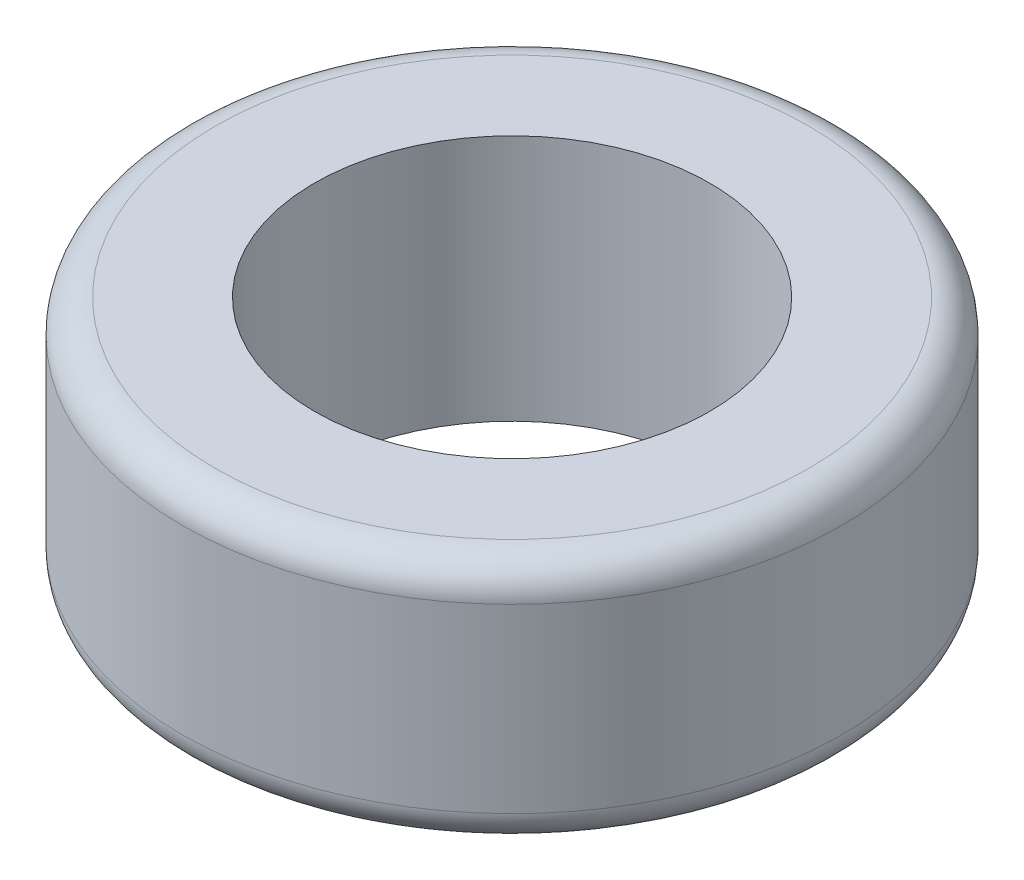
ISO-10303-21;
HEADER;
FILE_DESCRIPTION(('STEP AP214'),'2;1');
FILE_NAME('part.step','',(''),(''),'','','');
FILE_SCHEMA(('AUTOMOTIVE_DESIGN { 1 0 10303 214 1 1 1 1 }'));
ENDSEC;
DATA;
#1=APPLICATION_CONTEXT('core data for automotive mechanical design processes');
#2=APPLICATION_PROTOCOL_DEFINITION('international standard','automotive_design',2000,#1);
#3=PRODUCT_CONTEXT('',#1,'mechanical');
#4=PRODUCT('Part','Part','',(#3));
#5=PRODUCT_RELATED_PRODUCT_CATEGORY('part','',(#4));
#6=PRODUCT_DEFINITION_FORMATION('','',#4);
#7=PRODUCT_DEFINITION_CONTEXT('part definition',#1,'design');
#8=PRODUCT_DEFINITION('design','',#6,#7);
#9=PRODUCT_DEFINITION_SHAPE('','',#8);
#10=(LENGTH_UNIT() NAMED_UNIT(*) SI_UNIT(.MILLI.,.METRE.));
#11=(NAMED_UNIT(*) PLANE_ANGLE_UNIT() SI_UNIT($,.RADIAN.));
#12=(NAMED_UNIT(*) SI_UNIT($,.STERADIAN.) SOLID_ANGLE_UNIT());
#13=UNCERTAINTY_MEASURE_WITH_UNIT(LENGTH_MEASURE(1.E-05),#10,'distance_accuracy_value','');
#14=(GEOMETRIC_REPRESENTATION_CONTEXT(3) GLOBAL_UNCERTAINTY_ASSIGNED_CONTEXT((#13)) GLOBAL_UNIT_ASSIGNED_CONTEXT((#10,
#11,#12)) REPRESENTATION_CONTEXT('',''));
#15=CARTESIAN_POINT('',(0.,0.,0.));
#16=DIRECTION('',(0.,0.,1.));
#17=DIRECTION('',(1.,0.,0.));
#18=AXIS2_PLACEMENT_3D('',#15,#16,#17);
#19=CARTESIAN_POINT('',(0.,7.5,0.));
#20=DIRECTION('',(0.,1.,0.));
#21=DIRECTION('',(0.,0.,1.));
#22=AXIS2_PLACEMENT_3D('',#19,#20,#21);
#23=PLANE('',#22);
#24=CARTESIAN_POINT('',(0.,7.5,0.));
#25=DIRECTION('',(0.,1.,0.));
#26=DIRECTION('',(0.,0.,1.));
#27=AXIS2_PLACEMENT_3D('',#24,#25,#26);
#28=CIRCLE('',#27,9.);
#29=CARTESIAN_POINT('',(0.,7.5,9.));
#30=VERTEX_POINT('',#29);
#31=EDGE_CURVE('E10',#30,#30,#28,.T.);
#32=ORIENTED_EDGE('',*,*,#31,.T.);
#33=EDGE_LOOP('',(#32));
#34=FACE_BOUND('',#33,.T.);
#35=CARTESIAN_POINT('',(0.,7.5,0.));
#36=DIRECTION('',(0.,1.,0.));
#37=DIRECTION('',(0.,0.,1.));
#38=AXIS2_PLACEMENT_3D('',#35,#36,#37);
#39=CIRCLE('',#38,6.);
#40=CARTESIAN_POINT('',(0.,7.5,6.));
#41=VERTEX_POINT('',#40);
#42=EDGE_CURVE('E61',#41,#41,#39,.T.);
#43=ORIENTED_EDGE('',*,*,#42,.F.);
#44=EDGE_LOOP('',(#43));
#45=FACE_BOUND('',#44,.T.);
#46=ADVANCED_FACE('F37',(#34,#45),#23,.T.);
#47=CARTESIAN_POINT('',(0.,0.,0.));
#48=DIRECTION('',(0.,1.,0.));
#49=DIRECTION('',(0.,0.,1.));
#50=AXIS2_PLACEMENT_3D('',#47,#48,#49);
#51=PLANE('',#50);
#52=CARTESIAN_POINT('',(0.,0.,0.));
#53=DIRECTION('',(0.,1.,0.));
#54=DIRECTION('',(0.,0.,1.));
#55=AXIS2_PLACEMENT_3D('',#52,#53,#54);
#56=CIRCLE('',#55,9.);
#57=CARTESIAN_POINT('',(0.,0.,9.));
#58=VERTEX_POINT('',#57);
#59=EDGE_CURVE('E45',#58,#58,#56,.F.);
#60=ORIENTED_EDGE('',*,*,#59,.T.);
#61=EDGE_LOOP('',(#60));
#62=FACE_BOUND('',#61,.T.);
#63=CARTESIAN_POINT('',(0.,0.,0.));
#64=DIRECTION('',(0.,1.,0.));
#65=DIRECTION('',(0.,0.,1.));
#66=AXIS2_PLACEMENT_3D('',#63,#64,#65);
#67=CIRCLE('',#66,6.);
#68=CARTESIAN_POINT('',(0.,0.,6.));
#69=VERTEX_POINT('',#68);
#70=EDGE_CURVE('E62',#69,#69,#67,.T.);
#71=ORIENTED_EDGE('',*,*,#70,.T.);
#72=EDGE_LOOP('',(#71));
#73=FACE_BOUND('',#72,.T.);
#74=ADVANCED_FACE('F74',(#62,#73),#51,.F.);
#75=CARTESIAN_POINT('',(0.,7.5,0.));
#76=DIRECTION('',(0.,-1.,0.));
#77=DIRECTION('',(0.,0.,-1.));
#78=AXIS2_PLACEMENT_3D('',#75,#76,#77);
#79=CYLINDRICAL_SURFACE('',#78,10.);
#80=CARTESIAN_POINT('',(0.,1.,0.));
#81=DIRECTION('',(0.,1.,0.));
#82=DIRECTION('',(0.,0.,1.));
#83=AXIS2_PLACEMENT_3D('',#80,#81,#82);
#84=CIRCLE('',#83,10.);
#85=CARTESIAN_POINT('',(0.,1.,10.));
#86=VERTEX_POINT('',#85);
#87=EDGE_CURVE('E50',#86,#86,#84,.T.);
#88=ORIENTED_EDGE('',*,*,#87,.T.);
#89=EDGE_LOOP('',(#88));
#90=FACE_BOUND('',#89,.T.);
#91=CARTESIAN_POINT('',(0.,6.5,0.));
#92=DIRECTION('',(0.,1.,0.));
#93=DIRECTION('',(0.,0.,1.));
#94=AXIS2_PLACEMENT_3D('',#91,#92,#93);
#95=CIRCLE('',#94,10.);
#96=CARTESIAN_POINT('',(0.,6.5,10.));
#97=VERTEX_POINT('',#96);
#98=EDGE_CURVE('E55',#97,#97,#95,.F.);
#99=ORIENTED_EDGE('',*,*,#98,.T.);
#100=EDGE_LOOP('',(#99));
#101=FACE_BOUND('',#100,.T.);
#102=ADVANCED_FACE('F79',(#90,#101),#79,.T.);
#103=CARTESIAN_POINT('',(0.,7.5,0.));
#104=DIRECTION('',(0.,-1.,0.));
#105=DIRECTION('',(0.,0.,-1.));
#106=AXIS2_PLACEMENT_3D('',#103,#104,#105);
#107=CYLINDRICAL_SURFACE('',#106,6.);
#108=ORIENTED_EDGE('',*,*,#42,.T.);
#109=EDGE_LOOP('',(#108));
#110=FACE_BOUND('',#109,.T.);
#111=ORIENTED_EDGE('',*,*,#70,.F.);
#112=EDGE_LOOP('',(#111));
#113=FACE_BOUND('',#112,.T.);
#114=ADVANCED_FACE('F70',(#110,#113),#107,.F.);
#115=CARTESIAN_POINT('',(0.,1.,0.));
#116=DIRECTION('',(0.,1.,0.));
#117=DIRECTION('',(0.,0.,1.));
#118=AXIS2_PLACEMENT_3D('',#115,#116,#117);
#119=TOROIDAL_SURFACE('',#118,9.,1.);
#120=ORIENTED_EDGE('',*,*,#59,.F.);
#121=EDGE_LOOP('',(#120));
#122=FACE_BOUND('',#121,.T.);
#123=ORIENTED_EDGE('',*,*,#87,.F.);
#124=EDGE_LOOP('',(#123));
#125=FACE_BOUND('',#124,.T.);
#126=ADVANCED_FACE('F85',(#122,#125),#119,.T.);
#127=CARTESIAN_POINT('',(0.,6.5,0.));
#128=DIRECTION('',(0.,1.,0.));
#129=DIRECTION('',(0.,0.,1.));
#130=AXIS2_PLACEMENT_3D('',#127,#128,#129);
#131=TOROIDAL_SURFACE('',#130,9.,1.);
#132=ORIENTED_EDGE('',*,*,#98,.F.);
#133=EDGE_LOOP('',(#132));
#134=FACE_BOUND('',#133,.T.);
#135=ORIENTED_EDGE('',*,*,#31,.F.);
#136=EDGE_LOOP('',(#135));
#137=FACE_BOUND('',#136,.T.);
#138=ADVANCED_FACE('F39',(#134,#137),#131,.T.);
#139=CLOSED_SHELL('',(#46,#74,#102,#114,#126,#138));
#140=MANIFOLD_SOLID_BREP('B2',#139);
#141=ADVANCED_BREP_SHAPE_REPRESENTATION('',(#18,#140),#14);
#142=SHAPE_DEFINITION_REPRESENTATION(#9,#141);
ENDSEC;
END-ISO-10303-21;
